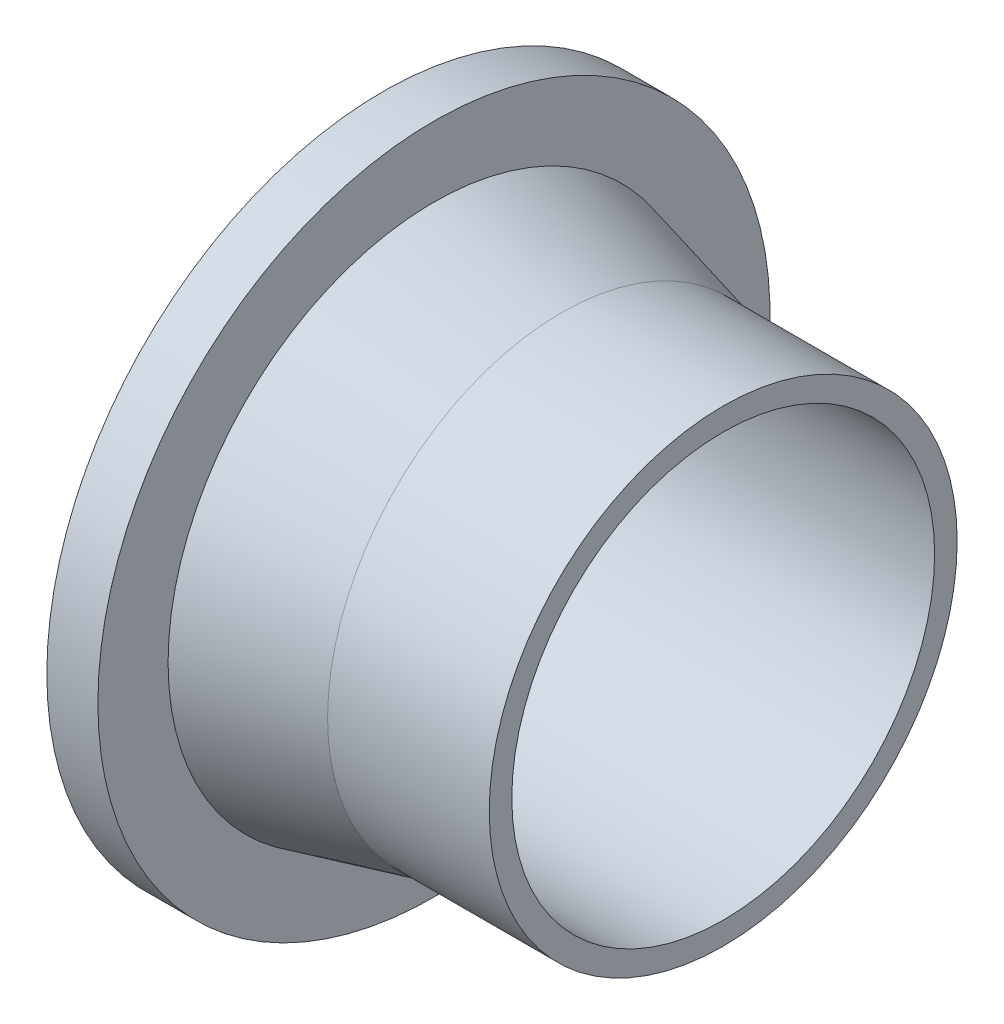
ISO-10303-21;
HEADER;
FILE_DESCRIPTION(('STEP AP214'),'2;1');
FILE_NAME('part.step','',(''),(''),'','','');
FILE_SCHEMA(('AUTOMOTIVE_DESIGN { 1 0 10303 214 1 1 1 1 }'));
ENDSEC;
DATA;
#1=APPLICATION_CONTEXT('core data for automotive mechanical design processes');
#2=APPLICATION_PROTOCOL_DEFINITION('international standard','automotive_design',2000,#1);
#3=PRODUCT_CONTEXT('',#1,'mechanical');
#4=PRODUCT('Part','Part','',(#3));
#5=PRODUCT_RELATED_PRODUCT_CATEGORY('part','',(#4));
#6=PRODUCT_DEFINITION_FORMATION('','',#4);
#7=PRODUCT_DEFINITION_CONTEXT('part definition',#1,'design');
#8=PRODUCT_DEFINITION('design','',#6,#7);
#9=PRODUCT_DEFINITION_SHAPE('','',#8);
#10=(LENGTH_UNIT() NAMED_UNIT(*) SI_UNIT(.MILLI.,.METRE.));
#11=(NAMED_UNIT(*) PLANE_ANGLE_UNIT() SI_UNIT($,.RADIAN.));
#12=(NAMED_UNIT(*) SI_UNIT($,.STERADIAN.) SOLID_ANGLE_UNIT());
#13=UNCERTAINTY_MEASURE_WITH_UNIT(LENGTH_MEASURE(1.E-05),#10,'distance_accuracy_value','');
#14=(GEOMETRIC_REPRESENTATION_CONTEXT(3) GLOBAL_UNCERTAINTY_ASSIGNED_CONTEXT((#13)) GLOBAL_UNIT_ASSIGNED_CONTEXT((#10,
#11,#12)) REPRESENTATION_CONTEXT('',''));
#15=CARTESIAN_POINT('',(0.,0.,0.));
#16=DIRECTION('',(0.,0.,1.));
#17=DIRECTION('',(1.,0.,0.));
#18=AXIS2_PLACEMENT_3D('',#15,#16,#17);
#19=CARTESIAN_POINT('',(-38.,0.,0.));
#20=DIRECTION('',(-1.,0.,0.));
#21=DIRECTION('',(0.,0.,1.));
#22=AXIS2_PLACEMENT_3D('',#19,#20,#21);
#23=CONICAL_SURFACE('',#22,55.,0.244978663126864);
#24=CARTESIAN_POINT('',(-68.,0.,0.));
#25=DIRECTION('',(-1.,0.,0.));
#26=DIRECTION('',(0.,0.,1.));
#27=AXIS2_PLACEMENT_3D('',#24,#25,#26);
#28=CIRCLE('',#27,62.5);
#29=CARTESIAN_POINT('',(-68.,0.,62.5));
#30=VERTEX_POINT('',#29);
#31=EDGE_CURVE('E16',#30,#30,#28,.T.);
#32=ORIENTED_EDGE('',*,*,#31,.F.);
#33=EDGE_LOOP('',(#32));
#34=FACE_BOUND('',#33,.T.);
#35=CARTESIAN_POINT('',(-38.,0.,0.));
#36=DIRECTION('',(-1.,0.,0.));
#37=DIRECTION('',(0.,1.,0.));
#38=AXIS2_PLACEMENT_3D('',#35,#36,#37);
#39=CIRCLE('',#38,55.);
#40=CARTESIAN_POINT('',(-38.,55.,0.));
#41=VERTEX_POINT('',#40);
#42=EDGE_CURVE('E28',#41,#41,#39,.F.);
#43=ORIENTED_EDGE('',*,*,#42,.F.);
#44=EDGE_LOOP('',(#43));
#45=FACE_BOUND('',#44,.T.);
#46=ADVANCED_FACE('F13',(#34,#45),#23,.T.);
#47=CARTESIAN_POINT('',(-68.,79.,79.9480031625341));
#48=DIRECTION('',(1.,0.,0.));
#49=DIRECTION('',(0.,-1.,0.));
#50=AXIS2_PLACEMENT_3D('',#47,#48,#49);
#51=PLANE('',#50);
#52=ORIENTED_EDGE('',*,*,#31,.T.);
#53=EDGE_LOOP('',(#52));
#54=FACE_BOUND('',#53,.T.);
#55=CARTESIAN_POINT('',(-68.,0.,0.));
#56=DIRECTION('',(-1.,0.,0.));
#57=DIRECTION('',(0.,0.,1.));
#58=AXIS2_PLACEMENT_3D('',#55,#56,#57);
#59=CIRCLE('',#58,79.);
#60=CARTESIAN_POINT('',(-68.,0.,79.));
#61=VERTEX_POINT('',#60);
#62=EDGE_CURVE('E34',#61,#61,#59,.T.);
#63=ORIENTED_EDGE('',*,*,#62,.F.);
#64=EDGE_LOOP('',(#63));
#65=FACE_BOUND('',#64,.T.);
#66=ADVANCED_FACE('F44',(#54,#65),#51,.T.);
#67=CARTESIAN_POINT('',(-38.,0.,0.));
#68=DIRECTION('',(-1.,0.,0.));
#69=DIRECTION('',(0.,0.,1.));
#70=AXIS2_PLACEMENT_3D('',#67,#68,#69);
#71=CYLINDRICAL_SURFACE('',#70,55.);
#72=ORIENTED_EDGE('',*,*,#42,.T.);
#73=EDGE_LOOP('',(#72));
#74=FACE_BOUND('',#73,.T.);
#75=CARTESIAN_POINT('',(0.,0.,0.));
#76=DIRECTION('',(-1.,0.,0.));
#77=DIRECTION('',(0.,0.,1.));
#78=AXIS2_PLACEMENT_3D('',#75,#76,#77);
#79=CIRCLE('',#78,55.);
#80=CARTESIAN_POINT('',(0.,0.,55.));
#81=VERTEX_POINT('',#80);
#82=EDGE_CURVE('E32',#81,#81,#79,.F.);
#83=ORIENTED_EDGE('',*,*,#82,.F.);
#84=EDGE_LOOP('',(#83));
#85=FACE_BOUND('',#84,.T.);
#86=ADVANCED_FACE('F53',(#74,#85),#71,.T.);
#87=CARTESIAN_POINT('',(-80.,0.,0.));
#88=DIRECTION('',(-1.,0.,0.));
#89=DIRECTION('',(0.,0.,1.));
#90=AXIS2_PLACEMENT_3D('',#87,#88,#89);
#91=CYLINDRICAL_SURFACE('',#90,79.);
#92=CARTESIAN_POINT('',(-80.,0.,0.));
#93=DIRECTION('',(-1.,0.,0.));
#94=DIRECTION('',(0.,0.,1.));
#95=AXIS2_PLACEMENT_3D('',#92,#93,#94);
#96=CIRCLE('',#95,79.);
#97=CARTESIAN_POINT('',(-80.,0.,79.));
#98=VERTEX_POINT('',#97);
#99=EDGE_CURVE('E25',#98,#98,#96,.T.);
#100=ORIENTED_EDGE('',*,*,#99,.F.);
#101=EDGE_LOOP('',(#100));
#102=FACE_BOUND('',#101,.T.);
#103=ORIENTED_EDGE('',*,*,#62,.T.);
#104=EDGE_LOOP('',(#103));
#105=FACE_BOUND('',#104,.T.);
#106=ADVANCED_FACE('F68',(#102,#105),#91,.T.);
#107=CARTESIAN_POINT('',(0.,55.,55.6600021081709));
#108=DIRECTION('',(1.,0.,0.));
#109=DIRECTION('',(0.,-1.,0.));
#110=AXIS2_PLACEMENT_3D('',#107,#108,#109);
#111=PLANE('',#110);
#112=CARTESIAN_POINT('',(0.,0.,0.));
#113=DIRECTION('',(-1.,0.,0.));
#114=DIRECTION('',(0.,0.,1.));
#115=AXIS2_PLACEMENT_3D('',#112,#113,#114);
#116=CIRCLE('',#115,49.7);
#117=CARTESIAN_POINT('',(0.,0.,49.7));
#118=VERTEX_POINT('',#117);
#119=EDGE_CURVE('E20',#118,#118,#116,.F.);
#120=ORIENTED_EDGE('',*,*,#119,.F.);
#121=EDGE_LOOP('',(#120));
#122=FACE_BOUND('',#121,.T.);
#123=ORIENTED_EDGE('',*,*,#82,.T.);
#124=EDGE_LOOP('',(#123));
#125=FACE_BOUND('',#124,.T.);
#126=ADVANCED_FACE('F62',(#122,#125),#111,.T.);
#127=CARTESIAN_POINT('',(-80.,-79.,79.9480031625361));
#128=DIRECTION('',(-1.,0.,0.));
#129=DIRECTION('',(0.,1.,0.));
#130=AXIS2_PLACEMENT_3D('',#127,#128,#129);
#131=PLANE('',#130);
#132=CARTESIAN_POINT('',(-80.,0.,0.));
#133=DIRECTION('',(-1.,0.,0.));
#134=DIRECTION('',(0.,0.,1.));
#135=AXIS2_PLACEMENT_3D('',#132,#133,#134);
#136=CIRCLE('',#135,49.7);
#137=CARTESIAN_POINT('',(-80.,0.,49.7));
#138=VERTEX_POINT('',#137);
#139=EDGE_CURVE('E8',#138,#138,#136,.T.);
#140=ORIENTED_EDGE('',*,*,#139,.F.);
#141=EDGE_LOOP('',(#140));
#142=FACE_BOUND('',#141,.T.);
#143=ORIENTED_EDGE('',*,*,#99,.T.);
#144=EDGE_LOOP('',(#143));
#145=FACE_BOUND('',#144,.T.);
#146=ADVANCED_FACE('F56',(#142,#145),#131,.T.);
#147=CARTESIAN_POINT('',(0.,0.,0.));
#148=DIRECTION('',(-1.,0.,0.));
#149=DIRECTION('',(0.,0.,1.));
#150=AXIS2_PLACEMENT_3D('',#147,#148,#149);
#151=CYLINDRICAL_SURFACE('',#150,49.7);
#152=ORIENTED_EDGE('',*,*,#119,.T.);
#153=EDGE_LOOP('',(#152));
#154=FACE_BOUND('',#153,.T.);
#155=ORIENTED_EDGE('',*,*,#139,.T.);
#156=EDGE_LOOP('',(#155));
#157=FACE_BOUND('',#156,.T.);
#158=ADVANCED_FACE('F54',(#154,#157),#151,.F.);
#159=CLOSED_SHELL('',(#46,#66,#86,#106,#126,#146,#158));
#160=MANIFOLD_SOLID_BREP('B1',#159);
#161=ADVANCED_BREP_SHAPE_REPRESENTATION('',(#18,#160),#14);
#162=SHAPE_DEFINITION_REPRESENTATION(#9,#161);
ENDSEC;
END-ISO-10303-21;
